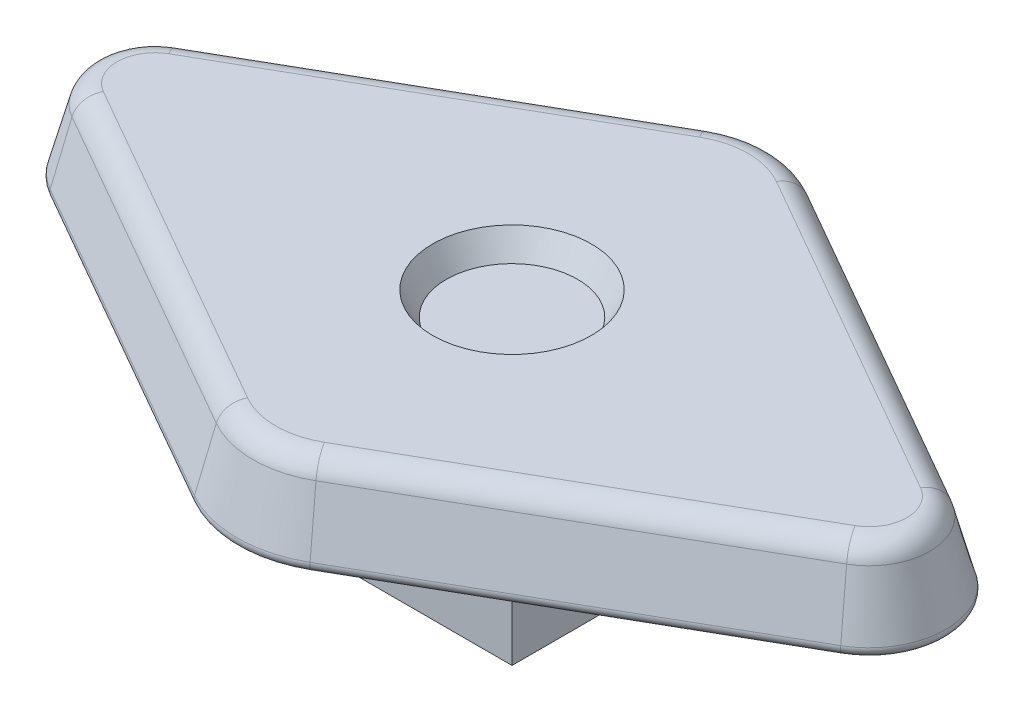
ISO-10303-21;
HEADER;
FILE_DESCRIPTION(('STEP AP214'),'2;1');
FILE_NAME('part.step','',(''),(''),'','','');
FILE_SCHEMA(('AUTOMOTIVE_DESIGN { 1 0 10303 214 1 1 1 1 }'));
ENDSEC;
DATA;
#1=APPLICATION_CONTEXT('core data for automotive mechanical design processes');
#2=APPLICATION_PROTOCOL_DEFINITION('international standard','automotive_design',2000,#1);
#3=PRODUCT_CONTEXT('',#1,'mechanical');
#4=PRODUCT('Part','Part','',(#3));
#5=PRODUCT_RELATED_PRODUCT_CATEGORY('part','',(#4));
#6=PRODUCT_DEFINITION_FORMATION('','',#4);
#7=PRODUCT_DEFINITION_CONTEXT('part definition',#1,'design');
#8=PRODUCT_DEFINITION('design','',#6,#7);
#9=PRODUCT_DEFINITION_SHAPE('','',#8);
#10=(LENGTH_UNIT() NAMED_UNIT(*) SI_UNIT(.MILLI.,.METRE.));
#11=(NAMED_UNIT(*) PLANE_ANGLE_UNIT() SI_UNIT($,.RADIAN.));
#12=(NAMED_UNIT(*) SI_UNIT($,.STERADIAN.) SOLID_ANGLE_UNIT());
#13=UNCERTAINTY_MEASURE_WITH_UNIT(LENGTH_MEASURE(1.E-05),#10,'distance_accuracy_value','');
#14=(GEOMETRIC_REPRESENTATION_CONTEXT(3) GLOBAL_UNCERTAINTY_ASSIGNED_CONTEXT((#13)) GLOBAL_UNIT_ASSIGNED_CONTEXT((#10,
#11,#12)) REPRESENTATION_CONTEXT('',''));
#15=CARTESIAN_POINT('',(0.,0.,0.));
#16=DIRECTION('',(0.,0.,1.));
#17=DIRECTION('',(1.,0.,0.));
#18=AXIS2_PLACEMENT_3D('',#15,#16,#17);
#19=CARTESIAN_POINT('',(1.27,2.54,1.27));
#20=DIRECTION('',(-1.,0.,0.));
#21=DIRECTION('',(0.,0.,1.));
#22=AXIS2_PLACEMENT_3D('',#19,#20,#21);
#23=PLANE('',#22);
#24=DIRECTION('',(0.,0.,-1.));
#25=VECTOR('',#24,1.);
#26=CARTESIAN_POINT('',(1.27,0.,1.27));
#27=LINE('',#26,#25);
#28=CARTESIAN_POINT('',(1.27,0.,1.27));
#29=VERTEX_POINT('',#28);
#30=CARTESIAN_POINT('',(1.27,0.,-1.27));
#31=VERTEX_POINT('',#30);
#32=EDGE_CURVE('E203',#29,#31,#27,.T.);
#33=ORIENTED_EDGE('',*,*,#32,.T.);
#34=DIRECTION('',(0.,-1.,0.));
#35=VECTOR('',#34,1.);
#36=CARTESIAN_POINT('',(1.27,2.54,-1.27));
#37=LINE('',#36,#35);
#38=CARTESIAN_POINT('',(1.27,2.54,-1.27));
#39=VERTEX_POINT('',#38);
#40=EDGE_CURVE('E180',#39,#31,#37,.T.);
#41=ORIENTED_EDGE('',*,*,#40,.F.);
#42=DIRECTION('',(0.,0.,-1.));
#43=VECTOR('',#42,1.);
#44=CARTESIAN_POINT('',(1.27,2.54,1.27));
#45=LINE('',#44,#43);
#46=CARTESIAN_POINT('',(1.27,2.54,1.27));
#47=VERTEX_POINT('',#46);
#48=EDGE_CURVE('E174',#47,#39,#45,.T.);
#49=ORIENTED_EDGE('',*,*,#48,.F.);
#50=DIRECTION('',(0.,-1.,0.));
#51=VECTOR('',#50,1.);
#52=CARTESIAN_POINT('',(1.27,2.54,1.27));
#53=LINE('',#52,#51);
#54=EDGE_CURVE('E177',#47,#29,#53,.T.);
#55=ORIENTED_EDGE('',*,*,#54,.T.);
#56=EDGE_LOOP('',(#33,#41,#49,#55));
#57=FACE_BOUND('',#56,.T.);
#58=ADVANCED_FACE('F34',(#57),#23,.F.);
#59=CARTESIAN_POINT('',(-1.27,2.54,-1.27));
#60=DIRECTION('',(0.,0.,1.));
#61=DIRECTION('',(1.,0.,0.));
#62=AXIS2_PLACEMENT_3D('',#59,#60,#61);
#63=PLANE('',#62);
#64=DIRECTION('',(-1.,0.,0.));
#65=VECTOR('',#64,1.);
#66=CARTESIAN_POINT('',(-1.27,0.,-1.27));
#67=LINE('',#66,#65);
#68=CARTESIAN_POINT('',(-1.27,0.,-1.27));
#69=VERTEX_POINT('',#68);
#70=EDGE_CURVE('E205',#31,#69,#67,.T.);
#71=ORIENTED_EDGE('',*,*,#70,.T.);
#72=DIRECTION('',(0.,-1.,0.));
#73=VECTOR('',#72,1.);
#74=CARTESIAN_POINT('',(-1.27,2.54,-1.27));
#75=LINE('',#74,#73);
#76=CARTESIAN_POINT('',(-1.27,2.54,-1.27));
#77=VERTEX_POINT('',#76);
#78=EDGE_CURVE('E212',#77,#69,#75,.T.);
#79=ORIENTED_EDGE('',*,*,#78,.F.);
#80=DIRECTION('',(-1.,0.,0.));
#81=VECTOR('',#80,1.);
#82=CARTESIAN_POINT('',(-1.27,2.54,-1.27));
#83=LINE('',#82,#81);
#84=EDGE_CURVE('E184',#39,#77,#83,.T.);
#85=ORIENTED_EDGE('',*,*,#84,.F.);
#86=ORIENTED_EDGE('',*,*,#40,.T.);
#87=EDGE_LOOP('',(#71,#79,#85,#86));
#88=FACE_BOUND('',#87,.T.);
#89=ADVANCED_FACE('F380',(#88),#63,.F.);
#90=CARTESIAN_POINT('',(-1.27,2.54,1.27));
#91=DIRECTION('',(1.,0.,0.));
#92=DIRECTION('',(0.,0.,-1.));
#93=AXIS2_PLACEMENT_3D('',#90,#91,#92);
#94=PLANE('',#93);
#95=DIRECTION('',(0.,0.,1.));
#96=VECTOR('',#95,1.);
#97=CARTESIAN_POINT('',(-1.27,0.,1.27));
#98=LINE('',#97,#96);
#99=CARTESIAN_POINT('',(-1.27,0.,1.27));
#100=VERTEX_POINT('',#99);
#101=EDGE_CURVE('E208',#69,#100,#98,.T.);
#102=ORIENTED_EDGE('',*,*,#101,.T.);
#103=DIRECTION('',(0.,-1.,0.));
#104=VECTOR('',#103,1.);
#105=CARTESIAN_POINT('',(-1.27,2.54,1.27));
#106=LINE('',#105,#104);
#107=CARTESIAN_POINT('',(-1.27,2.54,1.27));
#108=VERTEX_POINT('',#107);
#109=EDGE_CURVE('E194',#108,#100,#106,.T.);
#110=ORIENTED_EDGE('',*,*,#109,.F.);
#111=DIRECTION('',(0.,0.,1.));
#112=VECTOR('',#111,1.);
#113=CARTESIAN_POINT('',(-1.27,2.54,1.27));
#114=LINE('',#113,#112);
#115=EDGE_CURVE('E198',#77,#108,#114,.T.);
#116=ORIENTED_EDGE('',*,*,#115,.F.);
#117=ORIENTED_EDGE('',*,*,#78,.T.);
#118=EDGE_LOOP('',(#102,#110,#116,#117));
#119=FACE_BOUND('',#118,.T.);
#120=ADVANCED_FACE('F383',(#119),#94,.F.);
#121=CARTESIAN_POINT('',(-1.27,2.54,1.27));
#122=DIRECTION('',(0.,0.,-1.));
#123=DIRECTION('',(-1.,0.,0.));
#124=AXIS2_PLACEMENT_3D('',#121,#122,#123);
#125=PLANE('',#124);
#126=DIRECTION('',(1.,0.,0.));
#127=VECTOR('',#126,1.);
#128=CARTESIAN_POINT('',(-1.27,0.,1.27));
#129=LINE('',#128,#127);
#130=EDGE_CURVE('E185',#100,#29,#129,.T.);
#131=ORIENTED_EDGE('',*,*,#130,.T.);
#132=ORIENTED_EDGE('',*,*,#54,.F.);
#133=DIRECTION('',(1.,0.,0.));
#134=VECTOR('',#133,1.);
#135=CARTESIAN_POINT('',(-1.27,2.54,1.27));
#136=LINE('',#135,#134);
#137=EDGE_CURVE('E191',#108,#47,#136,.T.);
#138=ORIENTED_EDGE('',*,*,#137,.F.);
#139=ORIENTED_EDGE('',*,*,#109,.T.);
#140=EDGE_LOOP('',(#131,#132,#138,#139));
#141=FACE_BOUND('',#140,.T.);
#142=ADVANCED_FACE('F189',(#141),#125,.F.);
#143=CARTESIAN_POINT('',(0.,0.,0.));
#144=DIRECTION('',(0.,-1.,0.));
#145=DIRECTION('',(0.,0.,-1.));
#146=AXIS2_PLACEMENT_3D('',#143,#144,#145);
#147=PLANE('',#146);
#148=ORIENTED_EDGE('',*,*,#32,.F.);
#149=ORIENTED_EDGE('',*,*,#130,.F.);
#150=ORIENTED_EDGE('',*,*,#101,.F.);
#151=ORIENTED_EDGE('',*,*,#70,.F.);
#152=EDGE_LOOP('',(#148,#149,#150,#151));
#153=FACE_BOUND('',#152,.T.);
#154=ADVANCED_FACE('F385',(#153),#147,.T.);
#155=CARTESIAN_POINT('',(0.,2.54,-2.54));
#156=DIRECTION('',(0.,-1.,0.));
#157=DIRECTION('',(0.,0.,-1.));
#158=AXIS2_PLACEMENT_3D('',#155,#156,#157);
#159=PLANE('',#158);
#160=CARTESIAN_POINT('',(-5.715,2.54,0.));
#161=DIRECTION('',(0.,-1.,0.));
#162=DIRECTION('',(0.,0.,-1.));
#163=AXIS2_PLACEMENT_3D('',#160,#161,#162);
#164=CIRCLE('',#163,1.10449037764917);
#165=CARTESIAN_POINT('',(-6.2637362785125,2.54,0.958534032240823));
#166=VERTEX_POINT('',#165);
#167=CARTESIAN_POINT('',(-6.2637362785125,2.54,-0.958534032240823));
#168=VERTEX_POINT('',#167);
#169=EDGE_CURVE('E276',#166,#168,#164,.T.);
#170=ORIENTED_EDGE('',*,*,#169,.T.);
#171=DIRECTION('',(0.867851863300973,0.,-0.496823050355988));
#172=VECTOR('',#171,1.);
#173=CARTESIAN_POINT('',(-0.864218915488549,2.54,-4.04961996543694));
#174=LINE('',#173,#172);
#175=CARTESIAN_POINT('',(-0.864218915488549,2.54,-4.04961996543694));
#176=VERTEX_POINT('',#175);
#177=EDGE_CURVE('E290',#168,#176,#174,.T.);
#178=ORIENTED_EDGE('',*,*,#177,.T.);
#179=CARTESIAN_POINT('',(0.,2.54,-2.54));
#180=DIRECTION('',(0.,-1.,0.));
#181=DIRECTION('',(0.,0.,-1.));
#182=AXIS2_PLACEMENT_3D('',#179,#180,#181);
#183=CIRCLE('',#182,1.73949037764917);
#184=CARTESIAN_POINT('',(0.864218915488548,2.54,-4.04961996543694));
#185=VERTEX_POINT('',#184);
#186=EDGE_CURVE('E288',#176,#185,#183,.T.);
#187=ORIENTED_EDGE('',*,*,#186,.T.);
#188=DIRECTION('',(0.867851863300973,0.,0.496823050355988));
#189=VECTOR('',#188,1.);
#190=CARTESIAN_POINT('',(6.2637362785125,2.54,-0.958534032240823));
#191=LINE('',#190,#189);
#192=CARTESIAN_POINT('',(6.2637362785125,2.54,-0.958534032240823));
#193=VERTEX_POINT('',#192);
#194=EDGE_CURVE('E286',#185,#193,#191,.T.);
#195=ORIENTED_EDGE('',*,*,#194,.T.);
#196=CARTESIAN_POINT('',(5.715,2.54,0.));
#197=DIRECTION('',(0.,-1.,0.));
#198=DIRECTION('',(0.,0.,-1.));
#199=AXIS2_PLACEMENT_3D('',#196,#197,#198);
#200=CIRCLE('',#199,1.10449037764917);
#201=CARTESIAN_POINT('',(6.2637362785125,2.54,0.958534032240823));
#202=VERTEX_POINT('',#201);
#203=EDGE_CURVE('E284',#193,#202,#200,.T.);
#204=ORIENTED_EDGE('',*,*,#203,.T.);
#205=DIRECTION('',(-0.867851863300973,0.,0.496823050355988));
#206=VECTOR('',#205,1.);
#207=CARTESIAN_POINT('',(0.864218915488549,2.54,4.04961996543694));
#208=LINE('',#207,#206);
#209=CARTESIAN_POINT('',(0.864218915488549,2.54,4.04961996543694));
#210=VERTEX_POINT('',#209);
#211=EDGE_CURVE('E282',#202,#210,#208,.T.);
#212=ORIENTED_EDGE('',*,*,#211,.T.);
#213=CARTESIAN_POINT('',(0.,2.54,2.54));
#214=DIRECTION('',(0.,-1.,0.));
#215=DIRECTION('',(0.,0.,-1.));
#216=AXIS2_PLACEMENT_3D('',#213,#214,#215);
#217=CIRCLE('',#216,1.73949037764917);
#218=CARTESIAN_POINT('',(-0.864218915488548,2.54,4.04961996543694));
#219=VERTEX_POINT('',#218);
#220=EDGE_CURVE('E280',#210,#219,#217,.T.);
#221=ORIENTED_EDGE('',*,*,#220,.T.);
#222=DIRECTION('',(-0.867851863300973,0.,-0.496823050355988));
#223=VECTOR('',#222,1.);
#224=CARTESIAN_POINT('',(-6.2637362785125,2.54,0.958534032240823));
#225=LINE('',#224,#223);
#226=EDGE_CURVE('E278',#219,#166,#225,.T.);
#227=ORIENTED_EDGE('',*,*,#226,.T.);
#228=EDGE_LOOP('',(#170,#178,#187,#195,#204,#212,#221,#227));
#229=FACE_BOUND('',#228,.T.);
#230=ORIENTED_EDGE('',*,*,#48,.T.);
#231=ORIENTED_EDGE('',*,*,#84,.T.);
#232=ORIENTED_EDGE('',*,*,#115,.T.);
#233=ORIENTED_EDGE('',*,*,#137,.T.);
#234=EDGE_LOOP('',(#230,#231,#232,#233));
#235=FACE_BOUND('',#234,.T.);
#236=ADVANCED_FACE('F196',(#229,#235),#159,.T.);
#237=CARTESIAN_POINT('',(0.,2.54,-2.54));
#238=DIRECTION('',(0.,-1.,0.));
#239=DIRECTION('',(0.,0.,-1.));
#240=AXIS2_PLACEMENT_3D('',#237,#238,#239);
#241=CONICAL_SURFACE('',#240,1.905,0.261799387799149);
#242=DIRECTION('',(0.128587267478058,-0.965925826289068,-0.224616590550001));
#243=VECTOR('',#242,1.);
#244=CARTESIAN_POINT('',(0.946447910928157,2.54,-4.19325779958835));
#245=LINE('',#244,#243);
#246=CARTESIAN_POINT('',(0.798067302886125,3.65461005618406,-3.93406614760131));
#247=VERTEX_POINT('',#246);
#248=CARTESIAN_POINT('',(0.925165480848738,2.69987001872802,-4.15608159251269));
#249=VERTEX_POINT('',#248);
#250=EDGE_CURVE('E273',#247,#249,#245,.T.);
#251=ORIENTED_EDGE('',*,*,#250,.T.);
#252=CARTESIAN_POINT('',(0.,2.69987001872802,-2.54));
#253=DIRECTION('',(0.,-1.,0.));
#254=DIRECTION('',(0.,0.,-1.));
#255=AXIS2_PLACEMENT_3D('',#252,#253,#254);
#256=CIRCLE('',#255,1.86216295758788);
#257=CARTESIAN_POINT('',(-0.925165480848739,2.69987001872802,-4.15608159251269));
#258=VERTEX_POINT('',#257);
#259=EDGE_CURVE('E293',#249,#258,#256,.F.);
#260=ORIENTED_EDGE('',*,*,#259,.T.);
#261=DIRECTION('',(-0.128587267478059,-0.965925826289068,-0.224616590550001));
#262=VECTOR('',#261,1.);
#263=CARTESIAN_POINT('',(-0.946447910928158,2.54,-4.19325779958835));
#264=LINE('',#263,#262);
#265=CARTESIAN_POINT('',(-0.798067302886126,3.65461005618406,-3.93406614760131));
#266=VERTEX_POINT('',#265);
#267=EDGE_CURVE('E206',#266,#258,#264,.T.);
#268=ORIENTED_EDGE('',*,*,#267,.F.);
#269=CARTESIAN_POINT('',(0.,3.65461005618406,-2.54));
#270=DIRECTION('',(0.,1.,0.));
#271=DIRECTION('',(0.,0.,1.));
#272=AXIS2_PLACEMENT_3D('',#269,#270,#271);
#273=CIRCLE('',#272,1.60634113556987);
#274=EDGE_CURVE('E233',#266,#247,#273,.F.);
#275=ORIENTED_EDGE('',*,*,#274,.T.);
#276=EDGE_LOOP('',(#251,#260,#268,#275));
#277=FACE_BOUND('',#276,.T.);
#278=ADVANCED_FACE('F353',(#277),#241,.T.);
#279=CARTESIAN_POINT('',(-6.3459652739521,2.54,-1.10217186639223));
#280=DIRECTION('',(-0.479894215434563,0.258819045102521,-0.8382805281555));
#281=DIRECTION('',(-0.867851863300973,0.,0.496823050355988));
#282=AXIS2_PLACEMENT_3D('',#279,#280,#281);
#283=PLANE('',#282);
#284=ORIENTED_EDGE('',*,*,#267,.T.);
#285=DIRECTION('',(-0.867851863300973,0.,0.496823050355988));
#286=VECTOR('',#285,1.);
#287=CARTESIAN_POINT('',(-6.32468284387268,2.69987001872802,-1.06499565931657));
#288=LINE('',#287,#286);
#289=CARTESIAN_POINT('',(-6.32468284387268,2.69987001872802,-1.06499565931657));
#290=VERTEX_POINT('',#289);
#291=EDGE_CURVE('E250',#258,#290,#288,.T.);
#292=ORIENTED_EDGE('',*,*,#291,.T.);
#293=DIRECTION('',(-0.128587267478059,-0.965925826289068,-0.224616590550001));
#294=VECTOR('',#293,1.);
#295=CARTESIAN_POINT('',(-6.3459652739521,2.54,-1.10217186639223));
#296=LINE('',#295,#294);
#297=CARTESIAN_POINT('',(-6.19758466591007,3.65461005618406,-0.842980214405195));
#298=VERTEX_POINT('',#297);
#299=EDGE_CURVE('E360',#298,#290,#296,.T.);
#300=ORIENTED_EDGE('',*,*,#299,.F.);
#301=DIRECTION('',(-0.867851863300973,0.,0.496823050355988));
#302=VECTOR('',#301,1.);
#303=CARTESIAN_POINT('',(-6.19758466591007,3.65461005618406,-0.842980214405196));
#304=LINE('',#303,#302);
#305=EDGE_CURVE('E248',#298,#266,#304,.F.);
#306=ORIENTED_EDGE('',*,*,#305,.T.);
#307=EDGE_LOOP('',(#284,#292,#300,#306));
#308=FACE_BOUND('',#307,.T.);
#309=ADVANCED_FACE('F357',(#308),#283,.T.);
#310=CARTESIAN_POINT('',(-5.715,2.54,0.));
#311=DIRECTION('',(0.,-1.,0.));
#312=DIRECTION('',(0.,0.,1.));
#313=AXIS2_PLACEMENT_3D('',#310,#311,#312);
#314=CONICAL_SURFACE('',#313,1.27,0.261799387799149);
#315=ORIENTED_EDGE('',*,*,#299,.T.);
#316=CARTESIAN_POINT('',(-5.715,2.69987001872802,0.));
#317=DIRECTION('',(0.,-1.,0.));
#318=DIRECTION('',(0.,0.,-1.));
#319=AXIS2_PLACEMENT_3D('',#316,#317,#318);
#320=CIRCLE('',#319,1.22716295758788);
#321=CARTESIAN_POINT('',(-6.32468284387269,2.69987001872802,1.06499565931657));
#322=VERTEX_POINT('',#321);
#323=EDGE_CURVE('E11',#290,#322,#320,.F.);
#324=ORIENTED_EDGE('',*,*,#323,.T.);
#325=DIRECTION('',(-0.128587267478059,-0.965925826289068,0.224616590550001));
#326=VECTOR('',#325,1.);
#327=CARTESIAN_POINT('',(-6.34596527395211,2.54,1.10217186639223));
#328=LINE('',#327,#326);
#329=CARTESIAN_POINT('',(-6.19758466591007,3.65461005618406,0.842980214405195));
#330=VERTEX_POINT('',#329);
#331=EDGE_CURVE('E362',#330,#322,#328,.T.);
#332=ORIENTED_EDGE('',*,*,#331,.F.);
#333=CARTESIAN_POINT('',(-5.715,3.65461005618406,0.));
#334=DIRECTION('',(0.,1.,0.));
#335=DIRECTION('',(0.,0.,1.));
#336=AXIS2_PLACEMENT_3D('',#333,#334,#335);
#337=CIRCLE('',#336,0.971341135569871);
#338=EDGE_CURVE('E246',#330,#298,#337,.F.);
#339=ORIENTED_EDGE('',*,*,#338,.T.);
#340=EDGE_LOOP('',(#315,#324,#332,#339));
#341=FACE_BOUND('',#340,.T.);
#342=ADVANCED_FACE('F541',(#341),#314,.T.);
#343=CARTESIAN_POINT('',(-6.3459652739521,2.54,1.10217186639223));
#344=DIRECTION('',(-0.479894215434563,0.258819045102521,0.8382805281555));
#345=DIRECTION('',(0.867851863300973,0.,0.496823050355988));
#346=AXIS2_PLACEMENT_3D('',#343,#344,#345);
#347=PLANE('',#346);
#348=ORIENTED_EDGE('',*,*,#331,.T.);
#349=DIRECTION('',(0.867851863300973,0.,0.496823050355988));
#350=VECTOR('',#349,1.);
#351=CARTESIAN_POINT('',(-0.925165480848739,2.69987001872802,4.15608159251269));
#352=LINE('',#351,#350);
#353=CARTESIAN_POINT('',(-0.925165480848738,2.69987001872802,4.15608159251269));
#354=VERTEX_POINT('',#353);
#355=EDGE_CURVE('E43',#322,#354,#352,.T.);
#356=ORIENTED_EDGE('',*,*,#355,.T.);
#357=DIRECTION('',(-0.128587267478058,-0.965925826289068,0.224616590550001));
#358=VECTOR('',#357,1.);
#359=CARTESIAN_POINT('',(-0.946447910928157,2.54,4.19325779958835));
#360=LINE('',#359,#358);
#361=CARTESIAN_POINT('',(-0.798067302886125,3.65461005618406,3.93406614760131));
#362=VERTEX_POINT('',#361);
#363=EDGE_CURVE('E377',#362,#354,#360,.T.);
#364=ORIENTED_EDGE('',*,*,#363,.F.);
#365=DIRECTION('',(0.867851863300973,0.,0.496823050355988));
#366=VECTOR('',#365,1.);
#367=CARTESIAN_POINT('',(-6.19758466591007,3.65461005618406,0.842980214405195));
#368=LINE('',#367,#366);
#369=EDGE_CURVE('E244',#362,#330,#368,.F.);
#370=ORIENTED_EDGE('',*,*,#369,.T.);
#371=EDGE_LOOP('',(#348,#356,#364,#370));
#372=FACE_BOUND('',#371,.T.);
#373=ADVANCED_FACE('F533',(#372),#347,.T.);
#374=CARTESIAN_POINT('',(0.,2.54,2.54));
#375=DIRECTION('',(0.,-1.,0.));
#376=DIRECTION('',(0.,0.,1.));
#377=AXIS2_PLACEMENT_3D('',#374,#375,#376);
#378=CONICAL_SURFACE('',#377,1.905,0.261799387799149);
#379=ORIENTED_EDGE('',*,*,#363,.T.);
#380=CARTESIAN_POINT('',(0.,2.69987001872802,2.54));
#381=DIRECTION('',(0.,-1.,0.));
#382=DIRECTION('',(0.,0.,-1.));
#383=AXIS2_PLACEMENT_3D('',#380,#381,#382);
#384=CIRCLE('',#383,1.86216295758788);
#385=CARTESIAN_POINT('',(0.925165480848739,2.69987001872802,4.15608159251269));
#386=VERTEX_POINT('',#385);
#387=EDGE_CURVE('E301',#354,#386,#384,.F.);
#388=ORIENTED_EDGE('',*,*,#387,.T.);
#389=DIRECTION('',(0.128587267478059,-0.965925826289068,0.224616590550001));
#390=VECTOR('',#389,1.);
#391=CARTESIAN_POINT('',(0.946447910928158,2.54,4.19325779958835));
#392=LINE('',#391,#390);
#393=CARTESIAN_POINT('',(0.798067302886126,3.65461005618406,3.93406614760131));
#394=VERTEX_POINT('',#393);
#395=EDGE_CURVE('E374',#394,#386,#392,.T.);
#396=ORIENTED_EDGE('',*,*,#395,.F.);
#397=CARTESIAN_POINT('',(0.,3.65461005618406,2.54));
#398=DIRECTION('',(0.,1.,0.));
#399=DIRECTION('',(0.,0.,1.));
#400=AXIS2_PLACEMENT_3D('',#397,#398,#399);
#401=CIRCLE('',#400,1.60634113556987);
#402=EDGE_CURVE('E242',#394,#362,#401,.F.);
#403=ORIENTED_EDGE('',*,*,#402,.T.);
#404=EDGE_LOOP('',(#379,#388,#396,#403));
#405=FACE_BOUND('',#404,.T.);
#406=ADVANCED_FACE('F525',(#405),#378,.T.);
#407=CARTESIAN_POINT('',(6.3459652739521,2.54,1.10217186639223));
#408=DIRECTION('',(0.479894215434563,0.258819045102521,0.8382805281555));
#409=DIRECTION('',(0.867851863300973,0.,-0.496823050355988));
#410=AXIS2_PLACEMENT_3D('',#407,#408,#409);
#411=PLANE('',#410);
#412=ORIENTED_EDGE('',*,*,#395,.T.);
#413=DIRECTION('',(0.867851863300973,0.,-0.496823050355988));
#414=VECTOR('',#413,1.);
#415=CARTESIAN_POINT('',(6.32468284387268,2.69987001872802,1.06499565931657));
#416=LINE('',#415,#414);
#417=CARTESIAN_POINT('',(6.32468284387268,2.69987001872802,1.06499565931657));
#418=VERTEX_POINT('',#417);
#419=EDGE_CURVE('E299',#386,#418,#416,.T.);
#420=ORIENTED_EDGE('',*,*,#419,.T.);
#421=DIRECTION('',(0.128587267478059,-0.965925826289068,0.224616590550001));
#422=VECTOR('',#421,1.);
#423=CARTESIAN_POINT('',(6.3459652739521,2.54,1.10217186639223));
#424=LINE('',#423,#422);
#425=CARTESIAN_POINT('',(6.19758466591007,3.65461005618406,0.842980214405195));
#426=VERTEX_POINT('',#425);
#427=EDGE_CURVE('E371',#426,#418,#424,.T.);
#428=ORIENTED_EDGE('',*,*,#427,.F.);
#429=DIRECTION('',(0.867851863300973,0.,-0.496823050355988));
#430=VECTOR('',#429,1.);
#431=CARTESIAN_POINT('',(6.19758466591007,3.65461005618406,0.842980214405196));
#432=LINE('',#431,#430);
#433=EDGE_CURVE('E240',#426,#394,#432,.F.);
#434=ORIENTED_EDGE('',*,*,#433,.T.);
#435=EDGE_LOOP('',(#412,#420,#428,#434));
#436=FACE_BOUND('',#435,.T.);
#437=ADVANCED_FACE('F517',(#436),#411,.T.);
#438=CARTESIAN_POINT('',(5.715,2.54,0.));
#439=DIRECTION('',(0.,-1.,0.));
#440=DIRECTION('',(0.,0.,-1.));
#441=AXIS2_PLACEMENT_3D('',#438,#439,#440);
#442=CONICAL_SURFACE('',#441,1.27,0.261799387799149);
#443=ORIENTED_EDGE('',*,*,#427,.T.);
#444=CARTESIAN_POINT('',(5.715,2.69987001872802,0.));
#445=DIRECTION('',(0.,-1.,0.));
#446=DIRECTION('',(0.,0.,-1.));
#447=AXIS2_PLACEMENT_3D('',#444,#445,#446);
#448=CIRCLE('',#447,1.22716295758788);
#449=CARTESIAN_POINT('',(6.32468284387268,2.69987001872802,-1.06499565931657));
#450=VERTEX_POINT('',#449);
#451=EDGE_CURVE('E297',#418,#450,#448,.F.);
#452=ORIENTED_EDGE('',*,*,#451,.T.);
#453=DIRECTION('',(0.128587267478059,-0.965925826289068,-0.224616590550001));
#454=VECTOR('',#453,1.);
#455=CARTESIAN_POINT('',(6.3459652739521,2.54,-1.10217186639223));
#456=LINE('',#455,#454);
#457=CARTESIAN_POINT('',(6.19758466591007,3.65461005618406,-0.842980214405195));
#458=VERTEX_POINT('',#457);
#459=EDGE_CURVE('E368',#458,#450,#456,.T.);
#460=ORIENTED_EDGE('',*,*,#459,.F.);
#461=CARTESIAN_POINT('',(5.715,3.65461005618406,0.));
#462=DIRECTION('',(0.,1.,0.));
#463=DIRECTION('',(0.,0.,1.));
#464=AXIS2_PLACEMENT_3D('',#461,#462,#463);
#465=CIRCLE('',#464,0.971341135569871);
#466=EDGE_CURVE('E238',#458,#426,#465,.F.);
#467=ORIENTED_EDGE('',*,*,#466,.T.);
#468=EDGE_LOOP('',(#443,#452,#460,#467));
#469=FACE_BOUND('',#468,.T.);
#470=ADVANCED_FACE('F510',(#469),#442,.T.);
#471=CARTESIAN_POINT('',(6.3459652739521,2.54,-1.10217186639223));
#472=DIRECTION('',(0.479894215434563,0.258819045102521,-0.8382805281555));
#473=DIRECTION('',(-0.867851863300973,0.,-0.496823050355988));
#474=AXIS2_PLACEMENT_3D('',#471,#472,#473);
#475=PLANE('',#474);
#476=ORIENTED_EDGE('',*,*,#459,.T.);
#477=DIRECTION('',(-0.867851863300973,0.,-0.496823050355988));
#478=VECTOR('',#477,1.);
#479=CARTESIAN_POINT('',(0.925165480848739,2.69987001872802,-4.15608159251269));
#480=LINE('',#479,#478);
#481=EDGE_CURVE('E295',#450,#249,#480,.T.);
#482=ORIENTED_EDGE('',*,*,#481,.T.);
#483=ORIENTED_EDGE('',*,*,#250,.F.);
#484=DIRECTION('',(-0.867851863300973,0.,-0.496823050355988));
#485=VECTOR('',#484,1.);
#486=CARTESIAN_POINT('',(6.19758466591007,3.65461005618406,-0.842980214405196));
#487=LINE('',#486,#485);
#488=EDGE_CURVE('E236',#247,#458,#487,.F.);
#489=ORIENTED_EDGE('',*,*,#488,.T.);
#490=EDGE_LOOP('',(#476,#482,#483,#489));
#491=FACE_BOUND('',#490,.T.);
#492=ADVANCED_FACE('F502',(#491),#475,.T.);
#493=CARTESIAN_POINT('',(0.,3.937,-2.54));
#494=DIRECTION('',(0.,-1.,0.));
#495=DIRECTION('',(0.,0.,-1.));
#496=AXIS2_PLACEMENT_3D('',#493,#494,#495);
#497=PLANE('',#496);
#498=CARTESIAN_POINT('',(0.,3.937,0.));
#499=DIRECTION('',(0.,1.,0.));
#500=DIRECTION('',(0.,0.,1.));
#501=AXIS2_PLACEMENT_3D('',#498,#499,#500);
#502=CIRCLE('',#501,1.27);
#503=CARTESIAN_POINT('',(0.,3.937,1.27));
#504=VERTEX_POINT('',#503);
#505=EDGE_CURVE('E733',#504,#504,#502,.T.);
#506=ORIENTED_EDGE('',*,*,#505,.F.);
#507=EDGE_LOOP('',(#506));
#508=FACE_BOUND('',#507,.T.);
#509=DIRECTION('',(0.867851863300973,0.,0.496823050355988));
#510=VECTOR('',#509,1.);
#511=CARTESIAN_POINT('',(0.615227606805557,3.937,-3.61468126637407));
#512=LINE('',#511,#510);
#513=CARTESIAN_POINT('',(6.0147449698295,3.937,-0.52359533317795));
#514=VERTEX_POINT('',#513);
#515=CARTESIAN_POINT('',(0.615227606805557,3.937,-3.61468126637407));
#516=VERTEX_POINT('',#515);
#517=EDGE_CURVE('E228',#514,#516,#512,.F.);
#518=ORIENTED_EDGE('',*,*,#517,.T.);
#519=CARTESIAN_POINT('',(0.,3.937,-2.54));
#520=DIRECTION('',(0.,-1.,0.));
#521=DIRECTION('',(0.,0.,-1.));
#522=AXIS2_PLACEMENT_3D('',#519,#520,#521);
#523=CIRCLE('',#522,1.23832339575374);
#524=CARTESIAN_POINT('',(-0.615227606805557,3.937,-3.61468126637407));
#525=VERTEX_POINT('',#524);
#526=EDGE_CURVE('E230',#516,#525,#523,.F.);
#527=ORIENTED_EDGE('',*,*,#526,.T.);
#528=DIRECTION('',(0.867851863300973,0.,-0.496823050355988));
#529=VECTOR('',#528,1.);
#530=CARTESIAN_POINT('',(-0.615227606805557,3.937,-3.61468126637407));
#531=LINE('',#530,#529);
#532=CARTESIAN_POINT('',(-6.0147449698295,3.937,-0.52359533317795));
#533=VERTEX_POINT('',#532);
#534=EDGE_CURVE('E216',#525,#533,#531,.F.);
#535=ORIENTED_EDGE('',*,*,#534,.T.);
#536=CARTESIAN_POINT('',(-5.715,3.937,0.));
#537=DIRECTION('',(0.,-1.,0.));
#538=DIRECTION('',(0.,0.,-1.));
#539=AXIS2_PLACEMENT_3D('',#536,#537,#538);
#540=CIRCLE('',#539,0.603323395753736);
#541=CARTESIAN_POINT('',(-6.01474496982951,3.937,0.52359533317795));
#542=VERTEX_POINT('',#541);
#543=EDGE_CURVE('E218',#533,#542,#540,.F.);
#544=ORIENTED_EDGE('',*,*,#543,.T.);
#545=DIRECTION('',(-0.867851863300973,0.,-0.496823050355988));
#546=VECTOR('',#545,1.);
#547=CARTESIAN_POINT('',(-2.80556516151573,3.937,2.36076889807972));
#548=LINE('',#547,#546);
#549=CARTESIAN_POINT('',(-0.615227606805557,3.937,3.61468126637407));
#550=VERTEX_POINT('',#549);
#551=EDGE_CURVE('E220',#542,#550,#548,.F.);
#552=ORIENTED_EDGE('',*,*,#551,.T.);
#553=CARTESIAN_POINT('',(0.,3.937,2.54));
#554=DIRECTION('',(0.,-1.,0.));
#555=DIRECTION('',(0.,0.,-1.));
#556=AXIS2_PLACEMENT_3D('',#553,#554,#555);
#557=CIRCLE('',#556,1.23832339575374);
#558=CARTESIAN_POINT('',(0.615227606805558,3.937,3.61468126637407));
#559=VERTEX_POINT('',#558);
#560=EDGE_CURVE('E222',#550,#559,#557,.F.);
#561=ORIENTED_EDGE('',*,*,#560,.T.);
#562=DIRECTION('',(-0.867851863300973,0.,0.496823050355988));
#563=VECTOR('',#562,1.);
#564=CARTESIAN_POINT('',(2.80556516151573,3.937,2.36076889807972));
#565=LINE('',#564,#563);
#566=CARTESIAN_POINT('',(6.0147449698295,3.937,0.52359533317795));
#567=VERTEX_POINT('',#566);
#568=EDGE_CURVE('E224',#559,#567,#565,.F.);
#569=ORIENTED_EDGE('',*,*,#568,.T.);
#570=CARTESIAN_POINT('',(5.715,3.937,0.));
#571=DIRECTION('',(0.,-1.,0.));
#572=DIRECTION('',(0.,0.,-1.));
#573=AXIS2_PLACEMENT_3D('',#570,#571,#572);
#574=CIRCLE('',#573,0.603323395753736);
#575=EDGE_CURVE('E226',#567,#514,#574,.F.);
#576=ORIENTED_EDGE('',*,*,#575,.T.);
#577=EDGE_LOOP('',(#518,#527,#535,#544,#552,#561,#569,#576));
#578=FACE_BOUND('',#577,.T.);
#579=ADVANCED_FACE('F434',(#508,#578),#497,.F.);
#580=CARTESIAN_POINT('',(0.,3.556,2.54));
#581=DIRECTION('',(0.,-1.,0.));
#582=DIRECTION('',(0.,0.,-1.));
#583=AXIS2_PLACEMENT_3D('',#580,#581,#582);
#584=TOROIDAL_SURFACE('',#583,1.23832339575374,0.381);
#585=CARTESIAN_POINT('',(-0.615227606805557,3.556,3.61468126637407));
#586=DIRECTION('',(-0.867851863300973,0.,-0.496823050355988));
#587=DIRECTION('',(-0.496823050355988,0.,0.867851863300973));
#588=AXIS2_PLACEMENT_3D('',#585,#586,#587);
#589=CIRCLE('',#588,0.381);
#590=EDGE_CURVE('E267',#362,#550,#589,.T.);
#591=ORIENTED_EDGE('',*,*,#590,.F.);
#592=ORIENTED_EDGE('',*,*,#402,.F.);
#593=CARTESIAN_POINT('',(0.615227606805558,3.556,3.61468126637407));
#594=DIRECTION('',(0.867851863300973,0.,-0.496823050355988));
#595=DIRECTION('',(-0.496823050355988,0.,-0.867851863300973));
#596=AXIS2_PLACEMENT_3D('',#593,#594,#595);
#597=CIRCLE('',#596,0.381);
#598=EDGE_CURVE('E270',#559,#394,#597,.T.);
#599=ORIENTED_EDGE('',*,*,#598,.F.);
#600=ORIENTED_EDGE('',*,*,#560,.F.);
#601=EDGE_LOOP('',(#591,#592,#599,#600));
#602=FACE_BOUND('',#601,.T.);
#603=ADVANCED_FACE('F430',(#602),#584,.T.);
#604=CARTESIAN_POINT('',(2.80556516151573,3.556,2.36076889807972));
#605=DIRECTION('',(-0.867851863300973,0.,0.496823050355988));
#606=DIRECTION('',(0.496823050355988,0.,0.867851863300973));
#607=AXIS2_PLACEMENT_3D('',#604,#605,#606);
#608=CYLINDRICAL_SURFACE('',#607,0.381);
#609=ORIENTED_EDGE('',*,*,#598,.T.);
#610=ORIENTED_EDGE('',*,*,#433,.F.);
#611=CARTESIAN_POINT('',(6.0147449698295,3.556,0.52359533317795));
#612=DIRECTION('',(0.867851863300973,0.,-0.496823050355989));
#613=DIRECTION('',(-0.496823050355989,0.,-0.867851863300973));
#614=AXIS2_PLACEMENT_3D('',#611,#612,#613);
#615=CIRCLE('',#614,0.381);
#616=EDGE_CURVE('E264',#567,#426,#615,.T.);
#617=ORIENTED_EDGE('',*,*,#616,.F.);
#618=ORIENTED_EDGE('',*,*,#568,.F.);
#619=EDGE_LOOP('',(#609,#610,#617,#618));
#620=FACE_BOUND('',#619,.T.);
#621=ADVANCED_FACE('F426',(#620),#608,.T.);
#622=CARTESIAN_POINT('',(-2.80556516151573,3.556,2.36076889807972));
#623=DIRECTION('',(-0.867851863300973,0.,-0.496823050355988));
#624=DIRECTION('',(-0.496823050355988,0.,0.867851863300973));
#625=AXIS2_PLACEMENT_3D('',#622,#623,#624);
#626=CYLINDRICAL_SURFACE('',#625,0.381);
#627=ORIENTED_EDGE('',*,*,#590,.T.);
#628=ORIENTED_EDGE('',*,*,#551,.F.);
#629=CARTESIAN_POINT('',(-6.01474496982951,3.556,0.52359533317795));
#630=DIRECTION('',(-0.867851863300973,0.,-0.496823050355989));
#631=DIRECTION('',(-0.496823050355989,0.,0.867851863300973));
#632=AXIS2_PLACEMENT_3D('',#629,#630,#631);
#633=CIRCLE('',#632,0.381);
#634=EDGE_CURVE('E261',#330,#542,#633,.T.);
#635=ORIENTED_EDGE('',*,*,#634,.F.);
#636=ORIENTED_EDGE('',*,*,#369,.F.);
#637=EDGE_LOOP('',(#627,#628,#635,#636));
#638=FACE_BOUND('',#637,.T.);
#639=ADVANCED_FACE('F422',(#638),#626,.T.);
#640=CARTESIAN_POINT('',(5.715,3.556,0.));
#641=DIRECTION('',(0.,-1.,0.));
#642=DIRECTION('',(0.,0.,-1.));
#643=AXIS2_PLACEMENT_3D('',#640,#641,#642);
#644=TOROIDAL_SURFACE('',#643,0.603323395753736,0.381);
#645=ORIENTED_EDGE('',*,*,#616,.T.);
#646=ORIENTED_EDGE('',*,*,#466,.F.);
#647=CARTESIAN_POINT('',(6.0147449698295,3.556,-0.52359533317795));
#648=DIRECTION('',(-0.867851863300973,0.,-0.496823050355989));
#649=DIRECTION('',(-0.496823050355989,0.,0.867851863300973));
#650=AXIS2_PLACEMENT_3D('',#647,#648,#649);
#651=CIRCLE('',#650,0.381);
#652=EDGE_CURVE('E258',#514,#458,#651,.T.);
#653=ORIENTED_EDGE('',*,*,#652,.F.);
#654=ORIENTED_EDGE('',*,*,#575,.F.);
#655=EDGE_LOOP('',(#645,#646,#653,#654));
#656=FACE_BOUND('',#655,.T.);
#657=ADVANCED_FACE('F418',(#656),#644,.T.);
#658=CARTESIAN_POINT('',(-5.715,3.556,0.));
#659=DIRECTION('',(0.,-1.,0.));
#660=DIRECTION('',(0.,0.,-1.));
#661=AXIS2_PLACEMENT_3D('',#658,#659,#660);
#662=TOROIDAL_SURFACE('',#661,0.603323395753736,0.381);
#663=ORIENTED_EDGE('',*,*,#634,.T.);
#664=ORIENTED_EDGE('',*,*,#543,.F.);
#665=CARTESIAN_POINT('',(-6.0147449698295,3.556,-0.52359533317795));
#666=DIRECTION('',(0.867851863300973,0.,-0.496823050355989));
#667=DIRECTION('',(-0.496823050355989,0.,-0.867851863300973));
#668=AXIS2_PLACEMENT_3D('',#665,#666,#667);
#669=CIRCLE('',#668,0.381);
#670=EDGE_CURVE('E255',#298,#533,#669,.T.);
#671=ORIENTED_EDGE('',*,*,#670,.F.);
#672=ORIENTED_EDGE('',*,*,#338,.F.);
#673=EDGE_LOOP('',(#663,#664,#671,#672));
#674=FACE_BOUND('',#673,.T.);
#675=ADVANCED_FACE('F414',(#674),#662,.T.);
#676=CARTESIAN_POINT('',(0.615227606805557,3.556,-3.61468126637407));
#677=DIRECTION('',(0.867851863300973,0.,0.496823050355988));
#678=DIRECTION('',(0.496823050355988,0.,-0.867851863300973));
#679=AXIS2_PLACEMENT_3D('',#676,#677,#678);
#680=CYLINDRICAL_SURFACE('',#679,0.381);
#681=ORIENTED_EDGE('',*,*,#652,.T.);
#682=ORIENTED_EDGE('',*,*,#488,.F.);
#683=CARTESIAN_POINT('',(0.615227606805557,3.556,-3.61468126637407));
#684=DIRECTION('',(-0.867851863300974,0.,-0.496823050355988));
#685=DIRECTION('',(-0.496823050355988,0.,0.867851863300974));
#686=AXIS2_PLACEMENT_3D('',#683,#684,#685);
#687=CIRCLE('',#686,0.381);
#688=EDGE_CURVE('E253',#516,#247,#687,.T.);
#689=ORIENTED_EDGE('',*,*,#688,.F.);
#690=ORIENTED_EDGE('',*,*,#517,.F.);
#691=EDGE_LOOP('',(#681,#682,#689,#690));
#692=FACE_BOUND('',#691,.T.);
#693=ADVANCED_FACE('F410',(#692),#680,.T.);
#694=CARTESIAN_POINT('',(-0.615227606805557,3.556,-3.61468126637407));
#695=DIRECTION('',(0.867851863300973,0.,-0.496823050355988));
#696=DIRECTION('',(-0.496823050355988,0.,-0.867851863300973));
#697=AXIS2_PLACEMENT_3D('',#694,#695,#696);
#698=CYLINDRICAL_SURFACE('',#697,0.381);
#699=ORIENTED_EDGE('',*,*,#670,.T.);
#700=ORIENTED_EDGE('',*,*,#534,.F.);
#701=CARTESIAN_POINT('',(-0.615227606805558,3.556,-3.61468126637407));
#702=DIRECTION('',(0.867851863300973,0.,-0.496823050355988));
#703=DIRECTION('',(-0.496823050355988,0.,-0.867851863300973));
#704=AXIS2_PLACEMENT_3D('',#701,#702,#703);
#705=CIRCLE('',#704,0.381);
#706=EDGE_CURVE('E251',#266,#525,#705,.T.);
#707=ORIENTED_EDGE('',*,*,#706,.F.);
#708=ORIENTED_EDGE('',*,*,#305,.F.);
#709=EDGE_LOOP('',(#699,#700,#707,#708));
#710=FACE_BOUND('',#709,.T.);
#711=ADVANCED_FACE('F406',(#710),#698,.T.);
#712=CARTESIAN_POINT('',(0.,3.556,-2.54));
#713=DIRECTION('',(0.,-1.,0.));
#714=DIRECTION('',(0.,0.,-1.));
#715=AXIS2_PLACEMENT_3D('',#712,#713,#714);
#716=TOROIDAL_SURFACE('',#715,1.23832339575374,0.381);
#717=ORIENTED_EDGE('',*,*,#688,.T.);
#718=ORIENTED_EDGE('',*,*,#274,.F.);
#719=ORIENTED_EDGE('',*,*,#706,.T.);
#720=ORIENTED_EDGE('',*,*,#526,.F.);
#721=EDGE_LOOP('',(#717,#718,#719,#720));
#722=FACE_BOUND('',#721,.T.);
#723=ADVANCED_FACE('F403',(#722),#716,.T.);
#724=CARTESIAN_POINT('',(6.2637362785125,2.667,0.958534032240823));
#725=DIRECTION('',(0.867851863300973,0.,-0.496823050355988));
#726=DIRECTION('',(-0.496823050355988,0.,-0.867851863300973));
#727=AXIS2_PLACEMENT_3D('',#724,#725,#726);
#728=CYLINDRICAL_SURFACE('',#727,0.127);
#729=CARTESIAN_POINT('',(0.864218915488549,2.667,4.04961996543694));
#730=DIRECTION('',(-0.867851863300974,0.,0.496823050355988));
#731=DIRECTION('',(0.496823050355988,0.,0.867851863300974));
#732=AXIS2_PLACEMENT_3D('',#729,#730,#731);
#733=CIRCLE('',#732,0.127);
#734=EDGE_CURVE('E320',#210,#386,#733,.T.);
#735=ORIENTED_EDGE('',*,*,#734,.F.);
#736=ORIENTED_EDGE('',*,*,#211,.F.);
#737=CARTESIAN_POINT('',(6.2637362785125,2.667,0.958534032240824));
#738=DIRECTION('',(0.867851863300974,0.,-0.496823050355987));
#739=DIRECTION('',(-0.496823050355987,0.,-0.867851863300974));
#740=AXIS2_PLACEMENT_3D('',#737,#738,#739);
#741=CIRCLE('',#740,0.127);
#742=EDGE_CURVE('E38',#418,#202,#741,.T.);
#743=ORIENTED_EDGE('',*,*,#742,.F.);
#744=ORIENTED_EDGE('',*,*,#419,.F.);
#745=EDGE_LOOP('',(#735,#736,#743,#744));
#746=FACE_BOUND('',#745,.T.);
#747=ADVANCED_FACE('F36',(#746),#728,.T.);
#748=CARTESIAN_POINT('',(5.715,2.667,0.));
#749=DIRECTION('',(0.,-1.,0.));
#750=DIRECTION('',(0.,0.,-1.));
#751=AXIS2_PLACEMENT_3D('',#748,#749,#750);
#752=TOROIDAL_SURFACE('',#751,1.10449037764917,0.127);
#753=ORIENTED_EDGE('',*,*,#742,.T.);
#754=ORIENTED_EDGE('',*,*,#203,.F.);
#755=CARTESIAN_POINT('',(6.2637362785125,2.667,-0.958534032240823));
#756=DIRECTION('',(-0.867851863300974,0.,-0.496823050355987));
#757=DIRECTION('',(-0.496823050355987,0.,0.867851863300974));
#758=AXIS2_PLACEMENT_3D('',#755,#756,#757);
#759=CIRCLE('',#758,0.127);
#760=EDGE_CURVE('E318',#450,#193,#759,.T.);
#761=ORIENTED_EDGE('',*,*,#760,.F.);
#762=ORIENTED_EDGE('',*,*,#451,.F.);
#763=EDGE_LOOP('',(#753,#754,#761,#762));
#764=FACE_BOUND('',#763,.T.);
#765=ADVANCED_FACE('F331',(#764),#752,.T.);
#766=CARTESIAN_POINT('',(0.,2.667,2.54));
#767=DIRECTION('',(0.,-1.,0.));
#768=DIRECTION('',(0.,0.,-1.));
#769=AXIS2_PLACEMENT_3D('',#766,#767,#768);
#770=TOROIDAL_SURFACE('',#769,1.73949037764917,0.127);
#771=ORIENTED_EDGE('',*,*,#734,.T.);
#772=ORIENTED_EDGE('',*,*,#387,.F.);
#773=CARTESIAN_POINT('',(-0.864218915488548,2.667,4.04961996543694));
#774=DIRECTION('',(-0.867851863300973,0.,-0.49682305035599));
#775=DIRECTION('',(-0.49682305035599,0.,0.867851863300973));
#776=AXIS2_PLACEMENT_3D('',#773,#774,#775);
#777=CIRCLE('',#776,0.127);
#778=EDGE_CURVE('E315',#219,#354,#777,.T.);
#779=ORIENTED_EDGE('',*,*,#778,.F.);
#780=ORIENTED_EDGE('',*,*,#220,.F.);
#781=EDGE_LOOP('',(#771,#772,#779,#780));
#782=FACE_BOUND('',#781,.T.);
#783=ADVANCED_FACE('F453',(#782),#770,.T.);
#784=CARTESIAN_POINT('',(6.2637362785125,2.667,-0.958534032240823));
#785=DIRECTION('',(-0.867851863300973,0.,-0.496823050355988));
#786=DIRECTION('',(-0.496823050355988,0.,0.867851863300973));
#787=AXIS2_PLACEMENT_3D('',#784,#785,#786);
#788=CYLINDRICAL_SURFACE('',#787,0.127);
#789=ORIENTED_EDGE('',*,*,#760,.T.);
#790=ORIENTED_EDGE('',*,*,#194,.F.);
#791=CARTESIAN_POINT('',(0.864218915488548,2.667,-4.04961996543694));
#792=DIRECTION('',(-0.867851863300974,0.,-0.496823050355987));
#793=DIRECTION('',(-0.496823050355987,0.,0.867851863300974));
#794=AXIS2_PLACEMENT_3D('',#791,#792,#793);
#795=CIRCLE('',#794,0.127);
#796=EDGE_CURVE('E312',#249,#185,#795,.T.);
#797=ORIENTED_EDGE('',*,*,#796,.F.);
#798=ORIENTED_EDGE('',*,*,#481,.F.);
#799=EDGE_LOOP('',(#789,#790,#797,#798));
#800=FACE_BOUND('',#799,.T.);
#801=ADVANCED_FACE('F342',(#800),#788,.T.);
#802=CARTESIAN_POINT('',(-6.2637362785125,2.667,0.958534032240823));
#803=DIRECTION('',(0.867851863300973,0.,0.496823050355988));
#804=DIRECTION('',(0.496823050355988,0.,-0.867851863300973));
#805=AXIS2_PLACEMENT_3D('',#802,#803,#804);
#806=CYLINDRICAL_SURFACE('',#805,0.127);
#807=ORIENTED_EDGE('',*,*,#778,.T.);
#808=ORIENTED_EDGE('',*,*,#355,.F.);
#809=CARTESIAN_POINT('',(-6.2637362785125,2.667,0.958534032240823));
#810=DIRECTION('',(-0.867851863300974,0.,-0.496823050355987));
#811=DIRECTION('',(-0.496823050355987,0.,0.867851863300974));
#812=AXIS2_PLACEMENT_3D('',#809,#810,#811);
#813=CIRCLE('',#812,0.127);
#814=EDGE_CURVE('E309',#166,#322,#813,.T.);
#815=ORIENTED_EDGE('',*,*,#814,.F.);
#816=ORIENTED_EDGE('',*,*,#226,.F.);
#817=EDGE_LOOP('',(#807,#808,#815,#816));
#818=FACE_BOUND('',#817,.T.);
#819=ADVANCED_FACE('F447',(#818),#806,.T.);
#820=CARTESIAN_POINT('',(0.,2.667,-2.54));
#821=DIRECTION('',(0.,-1.,0.));
#822=DIRECTION('',(0.,0.,-1.));
#823=AXIS2_PLACEMENT_3D('',#820,#821,#822);
#824=TOROIDAL_SURFACE('',#823,1.73949037764917,0.127);
#825=ORIENTED_EDGE('',*,*,#796,.T.);
#826=ORIENTED_EDGE('',*,*,#186,.F.);
#827=CARTESIAN_POINT('',(-0.864218915488549,2.667,-4.04961996543694));
#828=DIRECTION('',(-0.867851863300973,0.,0.496823050355988));
#829=DIRECTION('',(0.496823050355988,0.,0.867851863300973));
#830=AXIS2_PLACEMENT_3D('',#827,#828,#829);
#831=CIRCLE('',#830,0.127);
#832=EDGE_CURVE('E306',#258,#176,#831,.T.);
#833=ORIENTED_EDGE('',*,*,#832,.F.);
#834=ORIENTED_EDGE('',*,*,#259,.F.);
#835=EDGE_LOOP('',(#825,#826,#833,#834));
#836=FACE_BOUND('',#835,.T.);
#837=ADVANCED_FACE('F346',(#836),#824,.T.);
#838=CARTESIAN_POINT('',(-5.715,2.667,0.));
#839=DIRECTION('',(0.,-1.,0.));
#840=DIRECTION('',(0.,0.,-1.));
#841=AXIS2_PLACEMENT_3D('',#838,#839,#840);
#842=TOROIDAL_SURFACE('',#841,1.10449037764917,0.127);
#843=ORIENTED_EDGE('',*,*,#814,.T.);
#844=ORIENTED_EDGE('',*,*,#323,.F.);
#845=CARTESIAN_POINT('',(-6.2637362785125,2.667,-0.958534032240823));
#846=DIRECTION('',(0.867851863300975,0.,-0.496823050355986));
#847=DIRECTION('',(-0.496823050355986,0.,-0.867851863300975));
#848=AXIS2_PLACEMENT_3D('',#845,#846,#847);
#849=CIRCLE('',#848,0.127);
#850=EDGE_CURVE('E304',#168,#290,#849,.T.);
#851=ORIENTED_EDGE('',*,*,#850,.F.);
#852=ORIENTED_EDGE('',*,*,#169,.F.);
#853=EDGE_LOOP('',(#843,#844,#851,#852));
#854=FACE_BOUND('',#853,.T.);
#855=ADVANCED_FACE('F440',(#854),#842,.T.);
#856=CARTESIAN_POINT('',(-6.2637362785125,2.667,-0.958534032240823));
#857=DIRECTION('',(-0.867851863300973,0.,0.496823050355988));
#858=DIRECTION('',(0.496823050355988,0.,0.867851863300973));
#859=AXIS2_PLACEMENT_3D('',#856,#857,#858);
#860=CYLINDRICAL_SURFACE('',#859,0.127);
#861=ORIENTED_EDGE('',*,*,#832,.T.);
#862=ORIENTED_EDGE('',*,*,#177,.F.);
#863=ORIENTED_EDGE('',*,*,#850,.T.);
#864=ORIENTED_EDGE('',*,*,#291,.F.);
#865=EDGE_LOOP('',(#861,#862,#863,#864));
#866=FACE_BOUND('',#865,.T.);
#867=ADVANCED_FACE('F436',(#866),#860,.T.);
#868=CARTESIAN_POINT('',(0.,3.937,0.));
#869=DIRECTION('',(0.,1.,0.));
#870=DIRECTION('',(0.,0.,1.));
#871=AXIS2_PLACEMENT_3D('',#868,#869,#870);
#872=CONICAL_SURFACE('',#871,1.27,0.5235987755983);
#873=CARTESIAN_POINT('',(0.,3.556,0.));
#874=DIRECTION('',(0.,1.,0.));
#875=DIRECTION('',(0.,0.,1.));
#876=AXIS2_PLACEMENT_3D('',#873,#874,#875);
#877=CIRCLE('',#876,1.05002954743875);
#878=CARTESIAN_POINT('',(0.,3.556,1.05002954743875));
#879=VERTEX_POINT('',#878);
#880=EDGE_CURVE('E307',#879,#879,#877,.T.);
#881=ORIENTED_EDGE('',*,*,#880,.F.);
#882=EDGE_LOOP('',(#881));
#883=FACE_BOUND('',#882,.T.);
#884=ORIENTED_EDGE('',*,*,#505,.T.);
#885=EDGE_LOOP('',(#884));
#886=FACE_BOUND('',#885,.T.);
#887=ADVANCED_FACE('F439',(#883,#886),#872,.F.);
#888=CARTESIAN_POINT('',(0.,3.556,0.));
#889=DIRECTION('',(0.,1.,0.));
#890=DIRECTION('',(0.,0.,1.));
#891=AXIS2_PLACEMENT_3D('',#888,#889,#890);
#892=PLANE('',#891);
#893=ORIENTED_EDGE('',*,*,#880,.T.);
#894=EDGE_LOOP('',(#893));
#895=FACE_BOUND('',#894,.T.);
#896=ADVANCED_FACE('F677',(#895),#892,.T.);
#897=CLOSED_SHELL('',(#58,#89,#120,#142,#154,#236,#278,#309,#342,#373,#406,#437,#470,#492,#579,
#603,#621,#639,#657,#675,#693,#711,#723,#747,#765,#783,#801,#819,#837,#855,#867,#887,#896));
#898=MANIFOLD_SOLID_BREP('B2',#897);
#899=ADVANCED_BREP_SHAPE_REPRESENTATION('',(#18,#898),#14);
#900=SHAPE_DEFINITION_REPRESENTATION(#9,#899);
ENDSEC;
END-ISO-10303-21;
